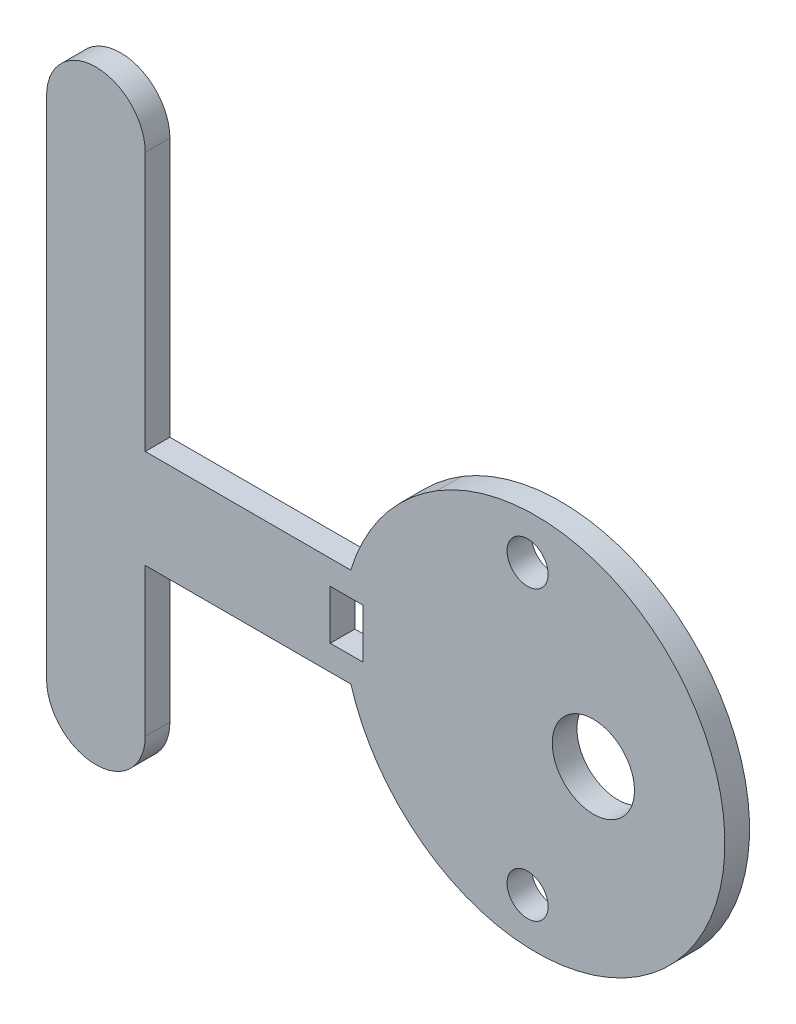
ISO-10303-21;
HEADER;
FILE_DESCRIPTION(('STEP AP214'),'2;1');
FILE_NAME('part.step','',(''),(''),'','','');
FILE_SCHEMA(('AUTOMOTIVE_DESIGN { 1 0 10303 214 1 1 1 1 }'));
ENDSEC;
DATA;
#1=APPLICATION_CONTEXT('core data for automotive mechanical design processes');
#2=APPLICATION_PROTOCOL_DEFINITION('international standard','automotive_design',2000,#1);
#3=PRODUCT_CONTEXT('',#1,'mechanical');
#4=PRODUCT('Part','Part','',(#3));
#5=PRODUCT_RELATED_PRODUCT_CATEGORY('part','',(#4));
#6=PRODUCT_DEFINITION_FORMATION('','',#4);
#7=PRODUCT_DEFINITION_CONTEXT('part definition',#1,'design');
#8=PRODUCT_DEFINITION('design','',#6,#7);
#9=PRODUCT_DEFINITION_SHAPE('','',#8);
#10=(LENGTH_UNIT() NAMED_UNIT(*) SI_UNIT(.MILLI.,.METRE.));
#11=(NAMED_UNIT(*) PLANE_ANGLE_UNIT() SI_UNIT($,.RADIAN.));
#12=(NAMED_UNIT(*) SI_UNIT($,.STERADIAN.) SOLID_ANGLE_UNIT());
#13=UNCERTAINTY_MEASURE_WITH_UNIT(LENGTH_MEASURE(1.E-05),#10,'distance_accuracy_value','');
#14=(GEOMETRIC_REPRESENTATION_CONTEXT(3) GLOBAL_UNCERTAINTY_ASSIGNED_CONTEXT((#13)) GLOBAL_UNIT_ASSIGNED_CONTEXT((#10,
#11,#12)) REPRESENTATION_CONTEXT('',''));
#15=CARTESIAN_POINT('',(0.,0.,0.));
#16=DIRECTION('',(0.,0.,1.));
#17=DIRECTION('',(1.,0.,0.));
#18=AXIS2_PLACEMENT_3D('',#15,#16,#17);
#19=CARTESIAN_POINT('',(98.2041937089408,89.4994362023154,3.));
#20=DIRECTION('',(0.,0.,1.));
#21=DIRECTION('',(1.,0.,0.));
#22=AXIS2_PLACEMENT_3D('',#19,#20,#21);
#23=PLANE('',#22);
#24=DIRECTION('',(0.,1.,0.));
#25=VECTOR('',#24,1.);
#26=CARTESIAN_POINT('',(130.704193708941,55.0489195834403,3.));
#27=LINE('',#26,#25);
#28=CARTESIAN_POINT('',(130.704193708941,49.0489195834403,3.));
#29=VERTEX_POINT('',#28);
#30=CARTESIAN_POINT('',(130.704193708941,55.0489195834403,3.));
#31=VERTEX_POINT('',#30);
#32=EDGE_CURVE('E47',#29,#31,#27,.T.);
#33=ORIENTED_EDGE('',*,*,#32,.F.);
#34=DIRECTION('',(1.,0.,0.));
#35=VECTOR('',#34,1.);
#36=CARTESIAN_POINT('',(126.704193708941,49.0489195834403,3.));
#37=LINE('',#36,#35);
#38=CARTESIAN_POINT('',(126.704193708941,49.0489195834403,3.));
#39=VERTEX_POINT('',#38);
#40=EDGE_CURVE('E151',#39,#29,#37,.T.);
#41=ORIENTED_EDGE('',*,*,#40,.F.);
#42=DIRECTION('',(0.,-1.,0.));
#43=VECTOR('',#42,1.);
#44=CARTESIAN_POINT('',(126.704193708941,55.0489195834403,3.));
#45=LINE('',#44,#43);
#46=CARTESIAN_POINT('',(126.704193708941,55.0489195834403,3.));
#47=VERTEX_POINT('',#46);
#48=EDGE_CURVE('E154',#47,#39,#45,.T.);
#49=ORIENTED_EDGE('',*,*,#48,.F.);
#50=DIRECTION('',(-1.,0.,0.));
#51=VECTOR('',#50,1.);
#52=CARTESIAN_POINT('',(126.704193708941,55.0489195834403,3.));
#53=LINE('',#52,#51);
#54=EDGE_CURVE('E160',#31,#47,#53,.T.);
#55=ORIENTED_EDGE('',*,*,#54,.F.);
#56=EDGE_LOOP('',(#33,#41,#49,#55));
#57=FACE_BOUND('',#56,.T.);
#58=CARTESIAN_POINT('',(150.704193708941,69.5489195834404,3.));
#59=DIRECTION('',(0.,0.,1.));
#60=DIRECTION('',(1.,0.,0.));
#61=AXIS2_PLACEMENT_3D('',#58,#59,#60);
#62=CIRCLE('',#61,2.5);
#63=CARTESIAN_POINT('',(153.204193708941,69.5489195834404,3.));
#64=VERTEX_POINT('',#63);
#65=EDGE_CURVE('E176',#64,#64,#62,.T.);
#66=ORIENTED_EDGE('',*,*,#65,.F.);
#67=EDGE_LOOP('',(#66));
#68=FACE_BOUND('',#67,.T.);
#69=CARTESIAN_POINT('',(98.2041937089408,89.4994362023154,3.));
#70=DIRECTION('',(0.,0.,1.));
#71=DIRECTION('',(1.,0.,0.));
#72=AXIS2_PLACEMENT_3D('',#69,#70,#71);
#73=CIRCLE('',#72,6.00000000000001);
#74=CARTESIAN_POINT('',(104.204193708941,89.4994362023154,3.));
#75=VERTEX_POINT('',#74);
#76=CARTESIAN_POINT('',(92.2041937089408,89.4994362023154,3.));
#77=VERTEX_POINT('',#76);
#78=EDGE_CURVE('E188',#75,#77,#73,.T.);
#79=ORIENTED_EDGE('',*,*,#78,.T.);
#80=DIRECTION('',(0.,-1.,0.));
#81=VECTOR('',#80,1.);
#82=CARTESIAN_POINT('',(92.2041937089408,89.4994362023154,3.));
#83=LINE('',#82,#81);
#84=CARTESIAN_POINT('',(92.2041937089408,27.9994362023154,3.));
#85=VERTEX_POINT('',#84);
#86=EDGE_CURVE('E191',#77,#85,#83,.T.);
#87=ORIENTED_EDGE('',*,*,#86,.T.);
#88=CARTESIAN_POINT('',(98.2041937089409,27.9994362023154,3.));
#89=DIRECTION('',(0.,0.,1.));
#90=DIRECTION('',(1.,0.,0.));
#91=AXIS2_PLACEMENT_3D('',#88,#89,#90);
#92=CIRCLE('',#91,6.00000000000003);
#93=CARTESIAN_POINT('',(104.204193708941,27.9994362023154,3.));
#94=VERTEX_POINT('',#93);
#95=EDGE_CURVE('E194',#85,#94,#92,.T.);
#96=ORIENTED_EDGE('',*,*,#95,.T.);
#97=DIRECTION('',(0.,1.,0.));
#98=VECTOR('',#97,1.);
#99=CARTESIAN_POINT('',(104.204193708941,27.9994362023154,3.));
#100=LINE('',#99,#98);
#101=CARTESIAN_POINT('',(104.204193708941,45.9994362023154,3.));
#102=VERTEX_POINT('',#101);
#103=EDGE_CURVE('E196',#94,#102,#100,.T.);
#104=ORIENTED_EDGE('',*,*,#103,.T.);
#105=DIRECTION('',(1.,0.,0.));
#106=VECTOR('',#105,1.);
#107=CARTESIAN_POINT('',(129.209700495455,45.9994362023154,3.));
#108=LINE('',#107,#106);
#109=CARTESIAN_POINT('',(129.209700495455,45.9994362023154,3.));
#110=VERTEX_POINT('',#109);
#111=EDGE_CURVE('E198',#102,#110,#108,.T.);
#112=ORIENTED_EDGE('',*,*,#111,.T.);
#113=CARTESIAN_POINT('',(152.268649146673,52.9115618881858,3.));
#114=DIRECTION('',(0.,0.,1.));
#115=DIRECTION('',(-1.,0.,0.));
#116=AXIS2_PLACEMENT_3D('',#113,#114,#115);
#117=CIRCLE('',#116,24.0726524171463);
#118=CARTESIAN_POINT('',(139.601041876798,32.441478340409,3.));
#119=VERTEX_POINT('',#118);
#120=EDGE_CURVE('E200',#110,#119,#117,.T.);
#121=ORIENTED_EDGE('',*,*,#120,.T.);
#122=CARTESIAN_POINT('',(151.704193708941,51.9994362023154,3.));
#123=DIRECTION('',(0.,0.,1.));
#124=DIRECTION('',(1.,0.,0.));
#125=AXIS2_PLACEMENT_3D('',#122,#123,#124);
#126=CIRCLE('',#125,23.0000000000002);
#127=CARTESIAN_POINT('',(139.68997160256,71.6121480795283,3.));
#128=VERTEX_POINT('',#127);
#129=EDGE_CURVE('E202',#119,#128,#126,.T.);
#130=ORIENTED_EDGE('',*,*,#129,.T.);
#131=CARTESIAN_POINT('',(152.268676795285,51.0779413244942,3.));
#132=DIRECTION('',(0.,0.,1.));
#133=DIRECTION('',(1.,0.,0.));
#134=AXIS2_PLACEMENT_3D('',#131,#132,#133);
#135=CIRCLE('',#134,24.0806451612901);
#136=CARTESIAN_POINT('',(129.204193708941,57.9994362023154,3.));
#137=VERTEX_POINT('',#136);
#138=EDGE_CURVE('E204',#128,#137,#135,.T.);
#139=ORIENTED_EDGE('',*,*,#138,.T.);
#140=DIRECTION('',(-1.,0.,0.));
#141=VECTOR('',#140,1.);
#142=CARTESIAN_POINT('',(129.204193708941,57.9994362023154,3.));
#143=LINE('',#142,#141);
#144=CARTESIAN_POINT('',(104.204193708941,57.9994362023154,3.));
#145=VERTEX_POINT('',#144);
#146=EDGE_CURVE('E206',#137,#145,#143,.T.);
#147=ORIENTED_EDGE('',*,*,#146,.T.);
#148=DIRECTION('',(0.,1.,0.));
#149=VECTOR('',#148,1.);
#150=CARTESIAN_POINT('',(104.204193708941,89.4994362023154,3.));
#151=LINE('',#150,#149);
#152=EDGE_CURVE('E208',#145,#75,#151,.T.);
#153=ORIENTED_EDGE('',*,*,#152,.T.);
#154=EDGE_LOOP('',(#79,#87,#96,#104,#112,#121,#130,#139,#147,#153));
#155=FACE_BOUND('',#154,.T.);
#156=CARTESIAN_POINT('',(158.704193708941,52.0489195834403,3.));
#157=DIRECTION('',(0.,0.,1.));
#158=DIRECTION('',(1.,0.,0.));
#159=AXIS2_PLACEMENT_3D('',#156,#157,#158);
#160=CIRCLE('',#159,4.99999999999999);
#161=CARTESIAN_POINT('',(163.704193708941,52.0489195834403,3.));
#162=VERTEX_POINT('',#161);
#163=EDGE_CURVE('E182',#162,#162,#160,.T.);
#164=ORIENTED_EDGE('',*,*,#163,.F.);
#165=EDGE_LOOP('',(#164));
#166=FACE_BOUND('',#165,.T.);
#167=CARTESIAN_POINT('',(150.704193708941,34.5489195834404,3.));
#168=DIRECTION('',(0.,0.,1.));
#169=DIRECTION('',(1.,0.,0.));
#170=AXIS2_PLACEMENT_3D('',#167,#168,#169);
#171=CIRCLE('',#170,2.5);
#172=CARTESIAN_POINT('',(153.204193708941,34.5489195834404,3.));
#173=VERTEX_POINT('',#172);
#174=EDGE_CURVE('E170',#173,#173,#171,.T.);
#175=ORIENTED_EDGE('',*,*,#174,.F.);
#176=EDGE_LOOP('',(#175));
#177=FACE_BOUND('',#176,.T.);
#178=ADVANCED_FACE('F32',(#57,#68,#155,#166,#177),#23,.T.);
#179=CARTESIAN_POINT('',(98.2041937089408,89.4994362023154,0.));
#180=DIRECTION('',(0.,0.,1.));
#181=DIRECTION('',(1.,0.,0.));
#182=AXIS2_PLACEMENT_3D('',#179,#180,#181);
#183=PLANE('',#182);
#184=DIRECTION('',(1.,0.,0.));
#185=VECTOR('',#184,1.);
#186=CARTESIAN_POINT('',(126.704193708941,49.0489195834403,0.));
#187=LINE('',#186,#185);
#188=CARTESIAN_POINT('',(126.704193708941,49.0489195834403,0.));
#189=VERTEX_POINT('',#188);
#190=CARTESIAN_POINT('',(130.704193708941,49.0489195834403,0.));
#191=VERTEX_POINT('',#190);
#192=EDGE_CURVE('E141',#189,#191,#187,.T.);
#193=ORIENTED_EDGE('',*,*,#192,.T.);
#194=DIRECTION('',(0.,1.,0.));
#195=VECTOR('',#194,1.);
#196=CARTESIAN_POINT('',(130.704193708941,55.0489195834403,0.));
#197=LINE('',#196,#195);
#198=CARTESIAN_POINT('',(130.704193708941,55.0489195834403,0.));
#199=VERTEX_POINT('',#198);
#200=EDGE_CURVE('E135',#191,#199,#197,.T.);
#201=ORIENTED_EDGE('',*,*,#200,.T.);
#202=DIRECTION('',(-1.,0.,0.));
#203=VECTOR('',#202,1.);
#204=CARTESIAN_POINT('',(126.704193708941,55.0489195834403,0.));
#205=LINE('',#204,#203);
#206=CARTESIAN_POINT('',(126.704193708941,55.0489195834403,0.));
#207=VERTEX_POINT('',#206);
#208=EDGE_CURVE('E144',#199,#207,#205,.T.);
#209=ORIENTED_EDGE('',*,*,#208,.T.);
#210=DIRECTION('',(0.,-1.,0.));
#211=VECTOR('',#210,1.);
#212=CARTESIAN_POINT('',(126.704193708941,55.0489195834403,0.));
#213=LINE('',#212,#211);
#214=EDGE_CURVE('E55',#207,#189,#213,.T.);
#215=ORIENTED_EDGE('',*,*,#214,.T.);
#216=EDGE_LOOP('',(#193,#201,#209,#215));
#217=FACE_BOUND('',#216,.T.);
#218=CARTESIAN_POINT('',(98.2041937089408,89.4994362023154,0.));
#219=DIRECTION('',(0.,0.,1.));
#220=DIRECTION('',(1.,0.,0.));
#221=AXIS2_PLACEMENT_3D('',#218,#219,#220);
#222=CIRCLE('',#221,6.00000000000001);
#223=CARTESIAN_POINT('',(104.204193708941,89.4994362023154,0.));
#224=VERTEX_POINT('',#223);
#225=CARTESIAN_POINT('',(92.2041937089408,89.4994362023154,0.));
#226=VERTEX_POINT('',#225);
#227=EDGE_CURVE('E185',#224,#226,#222,.T.);
#228=ORIENTED_EDGE('',*,*,#227,.F.);
#229=DIRECTION('',(0.,1.,0.));
#230=VECTOR('',#229,1.);
#231=CARTESIAN_POINT('',(104.204193708941,89.4994362023154,0.));
#232=LINE('',#231,#230);
#233=CARTESIAN_POINT('',(104.204193708941,57.9994362023154,0.));
#234=VERTEX_POINT('',#233);
#235=EDGE_CURVE('E192',#234,#224,#232,.T.);
#236=ORIENTED_EDGE('',*,*,#235,.F.);
#237=DIRECTION('',(-1.,0.,0.));
#238=VECTOR('',#237,1.);
#239=CARTESIAN_POINT('',(129.204193708941,57.9994362023154,0.));
#240=LINE('',#239,#238);
#241=CARTESIAN_POINT('',(129.204193708941,57.9994362023154,0.));
#242=VERTEX_POINT('',#241);
#243=EDGE_CURVE('E227',#242,#234,#240,.T.);
#244=ORIENTED_EDGE('',*,*,#243,.F.);
#245=CARTESIAN_POINT('',(152.268676795285,51.0779413244942,0.));
#246=DIRECTION('',(0.,0.,1.));
#247=DIRECTION('',(1.,0.,0.));
#248=AXIS2_PLACEMENT_3D('',#245,#246,#247);
#249=CIRCLE('',#248,24.0806451612901);
#250=CARTESIAN_POINT('',(139.68997160256,71.6121480795283,0.));
#251=VERTEX_POINT('',#250);
#252=EDGE_CURVE('E225',#251,#242,#249,.T.);
#253=ORIENTED_EDGE('',*,*,#252,.F.);
#254=CARTESIAN_POINT('',(151.704193708941,51.9994362023154,0.));
#255=DIRECTION('',(0.,0.,1.));
#256=DIRECTION('',(1.,0.,0.));
#257=AXIS2_PLACEMENT_3D('',#254,#255,#256);
#258=CIRCLE('',#257,23.0000000000002);
#259=CARTESIAN_POINT('',(139.601041876798,32.441478340409,0.));
#260=VERTEX_POINT('',#259);
#261=EDGE_CURVE('E223',#260,#251,#258,.T.);
#262=ORIENTED_EDGE('',*,*,#261,.F.);
#263=CARTESIAN_POINT('',(152.268649146673,52.9115618881858,0.));
#264=DIRECTION('',(0.,0.,1.));
#265=DIRECTION('',(-1.,0.,0.));
#266=AXIS2_PLACEMENT_3D('',#263,#264,#265);
#267=CIRCLE('',#266,24.0726524171463);
#268=CARTESIAN_POINT('',(129.209700495455,45.9994362023154,0.));
#269=VERTEX_POINT('',#268);
#270=EDGE_CURVE('E221',#269,#260,#267,.T.);
#271=ORIENTED_EDGE('',*,*,#270,.F.);
#272=DIRECTION('',(1.,0.,0.));
#273=VECTOR('',#272,1.);
#274=CARTESIAN_POINT('',(129.209700495455,45.9994362023154,0.));
#275=LINE('',#274,#273);
#276=CARTESIAN_POINT('',(104.204193708941,45.9994362023154,0.));
#277=VERTEX_POINT('',#276);
#278=EDGE_CURVE('E219',#277,#269,#275,.T.);
#279=ORIENTED_EDGE('',*,*,#278,.F.);
#280=DIRECTION('',(0.,1.,0.));
#281=VECTOR('',#280,1.);
#282=CARTESIAN_POINT('',(104.204193708941,27.9994362023154,0.));
#283=LINE('',#282,#281);
#284=CARTESIAN_POINT('',(104.204193708941,27.9994362023154,0.));
#285=VERTEX_POINT('',#284);
#286=EDGE_CURVE('E217',#285,#277,#283,.T.);
#287=ORIENTED_EDGE('',*,*,#286,.F.);
#288=CARTESIAN_POINT('',(98.2041937089409,27.9994362023154,0.));
#289=DIRECTION('',(0.,0.,1.));
#290=DIRECTION('',(1.,0.,0.));
#291=AXIS2_PLACEMENT_3D('',#288,#289,#290);
#292=CIRCLE('',#291,6.00000000000003);
#293=CARTESIAN_POINT('',(92.2041937089408,27.9994362023154,0.));
#294=VERTEX_POINT('',#293);
#295=EDGE_CURVE('E215',#294,#285,#292,.T.);
#296=ORIENTED_EDGE('',*,*,#295,.F.);
#297=DIRECTION('',(0.,-1.,0.));
#298=VECTOR('',#297,1.);
#299=CARTESIAN_POINT('',(92.2041937089408,89.4994362023154,0.));
#300=LINE('',#299,#298);
#301=EDGE_CURVE('E213',#226,#294,#300,.T.);
#302=ORIENTED_EDGE('',*,*,#301,.F.);
#303=EDGE_LOOP('',(#228,#236,#244,#253,#262,#271,#279,#287,#296,#302));
#304=FACE_BOUND('',#303,.T.);
#305=CARTESIAN_POINT('',(158.704193708941,52.0489195834403,0.));
#306=DIRECTION('',(0.,0.,1.));
#307=DIRECTION('',(1.,0.,0.));
#308=AXIS2_PLACEMENT_3D('',#305,#306,#307);
#309=CIRCLE('',#308,4.99999999999999);
#310=CARTESIAN_POINT('',(163.704193708941,52.0489195834403,0.));
#311=VERTEX_POINT('',#310);
#312=EDGE_CURVE('E179',#311,#311,#309,.T.);
#313=ORIENTED_EDGE('',*,*,#312,.T.);
#314=EDGE_LOOP('',(#313));
#315=FACE_BOUND('',#314,.T.);
#316=CARTESIAN_POINT('',(150.704193708941,69.5489195834404,0.));
#317=DIRECTION('',(0.,0.,1.));
#318=DIRECTION('',(1.,0.,0.));
#319=AXIS2_PLACEMENT_3D('',#316,#317,#318);
#320=CIRCLE('',#319,2.5);
#321=CARTESIAN_POINT('',(153.204193708941,69.5489195834404,0.));
#322=VERTEX_POINT('',#321);
#323=EDGE_CURVE('E173',#322,#322,#320,.T.);
#324=ORIENTED_EDGE('',*,*,#323,.T.);
#325=EDGE_LOOP('',(#324));
#326=FACE_BOUND('',#325,.T.);
#327=CARTESIAN_POINT('',(150.704193708941,34.5489195834404,0.));
#328=DIRECTION('',(0.,0.,1.));
#329=DIRECTION('',(1.,0.,0.));
#330=AXIS2_PLACEMENT_3D('',#327,#328,#329);
#331=CIRCLE('',#330,2.5);
#332=CARTESIAN_POINT('',(153.204193708941,34.5489195834404,0.));
#333=VERTEX_POINT('',#332);
#334=EDGE_CURVE('E166',#333,#333,#331,.T.);
#335=ORIENTED_EDGE('',*,*,#334,.T.);
#336=EDGE_LOOP('',(#335));
#337=FACE_BOUND('',#336,.T.);
#338=ADVANCED_FACE('F148',(#217,#304,#315,#326,#337),#183,.F.);
#339=CARTESIAN_POINT('',(98.2041937089408,89.4994362023154,3.));
#340=DIRECTION('',(0.,0.,-1.));
#341=DIRECTION('',(-1.,0.,0.));
#342=AXIS2_PLACEMENT_3D('',#339,#340,#341);
#343=CYLINDRICAL_SURFACE('',#342,6.00000000000001);
#344=ORIENTED_EDGE('',*,*,#227,.T.);
#345=DIRECTION('',(0.,0.,-1.));
#346=VECTOR('',#345,1.);
#347=CARTESIAN_POINT('',(92.2041937089408,89.4994362023154,3.));
#348=LINE('',#347,#346);
#349=EDGE_CURVE('E11',#77,#226,#348,.T.);
#350=ORIENTED_EDGE('',*,*,#349,.F.);
#351=ORIENTED_EDGE('',*,*,#78,.F.);
#352=DIRECTION('',(0.,0.,-1.));
#353=VECTOR('',#352,1.);
#354=CARTESIAN_POINT('',(104.204193708941,89.4994362023154,3.));
#355=LINE('',#354,#353);
#356=EDGE_CURVE('E210',#75,#224,#355,.T.);
#357=ORIENTED_EDGE('',*,*,#356,.T.);
#358=EDGE_LOOP('',(#344,#350,#351,#357));
#359=FACE_BOUND('',#358,.T.);
#360=ADVANCED_FACE('F34',(#359),#343,.T.);
#361=CARTESIAN_POINT('',(92.2041937089408,89.4994362023154,3.));
#362=DIRECTION('',(1.,0.,0.));
#363=DIRECTION('',(0.,1.,0.));
#364=AXIS2_PLACEMENT_3D('',#361,#362,#363);
#365=PLANE('',#364);
#366=ORIENTED_EDGE('',*,*,#301,.T.);
#367=DIRECTION('',(0.,0.,-1.));
#368=VECTOR('',#367,1.);
#369=CARTESIAN_POINT('',(92.2041937089408,27.9994362023154,3.));
#370=LINE('',#369,#368);
#371=EDGE_CURVE('E40',#85,#294,#370,.T.);
#372=ORIENTED_EDGE('',*,*,#371,.F.);
#373=ORIENTED_EDGE('',*,*,#86,.F.);
#374=ORIENTED_EDGE('',*,*,#349,.T.);
#375=EDGE_LOOP('',(#366,#372,#373,#374));
#376=FACE_BOUND('',#375,.T.);
#377=ADVANCED_FACE('F279',(#376),#365,.F.);
#378=CARTESIAN_POINT('',(98.2041937089409,27.9994362023154,3.));
#379=DIRECTION('',(0.,0.,-1.));
#380=DIRECTION('',(-1.,0.,0.));
#381=AXIS2_PLACEMENT_3D('',#378,#379,#380);
#382=CYLINDRICAL_SURFACE('',#381,6.00000000000003);
#383=ORIENTED_EDGE('',*,*,#295,.T.);
#384=DIRECTION('',(0.,0.,-1.));
#385=VECTOR('',#384,1.);
#386=CARTESIAN_POINT('',(104.204193708941,27.9994362023154,3.));
#387=LINE('',#386,#385);
#388=EDGE_CURVE('E250',#94,#285,#387,.T.);
#389=ORIENTED_EDGE('',*,*,#388,.F.);
#390=ORIENTED_EDGE('',*,*,#95,.F.);
#391=ORIENTED_EDGE('',*,*,#371,.T.);
#392=EDGE_LOOP('',(#383,#389,#390,#391));
#393=FACE_BOUND('',#392,.T.);
#394=ADVANCED_FACE('F257',(#393),#382,.T.);
#395=CARTESIAN_POINT('',(104.204193708941,27.9994362023154,3.));
#396=DIRECTION('',(-1.,0.,0.));
#397=DIRECTION('',(0.,-1.,0.));
#398=AXIS2_PLACEMENT_3D('',#395,#396,#397);
#399=PLANE('',#398);
#400=ORIENTED_EDGE('',*,*,#286,.T.);
#401=DIRECTION('',(0.,0.,-1.));
#402=VECTOR('',#401,1.);
#403=CARTESIAN_POINT('',(104.204193708941,45.9994362023154,3.));
#404=LINE('',#403,#402);
#405=EDGE_CURVE('E247',#102,#277,#404,.T.);
#406=ORIENTED_EDGE('',*,*,#405,.F.);
#407=ORIENTED_EDGE('',*,*,#103,.F.);
#408=ORIENTED_EDGE('',*,*,#388,.T.);
#409=EDGE_LOOP('',(#400,#406,#407,#408));
#410=FACE_BOUND('',#409,.T.);
#411=ADVANCED_FACE('F267',(#410),#399,.F.);
#412=CARTESIAN_POINT('',(129.209700495455,45.9994362023154,3.));
#413=DIRECTION('',(0.,1.,0.));
#414=DIRECTION('',(0.,0.,1.));
#415=AXIS2_PLACEMENT_3D('',#412,#413,#414);
#416=PLANE('',#415);
#417=ORIENTED_EDGE('',*,*,#278,.T.);
#418=DIRECTION('',(0.,0.,-1.));
#419=VECTOR('',#418,1.);
#420=CARTESIAN_POINT('',(129.209700495455,45.9994362023154,3.));
#421=LINE('',#420,#419);
#422=EDGE_CURVE('E244',#110,#269,#421,.T.);
#423=ORIENTED_EDGE('',*,*,#422,.F.);
#424=ORIENTED_EDGE('',*,*,#111,.F.);
#425=ORIENTED_EDGE('',*,*,#405,.T.);
#426=EDGE_LOOP('',(#417,#423,#424,#425));
#427=FACE_BOUND('',#426,.T.);
#428=ADVANCED_FACE('F271',(#427),#416,.F.);
#429=CARTESIAN_POINT('',(152.268649146673,52.9115618881858,3.));
#430=DIRECTION('',(0.,0.,-1.));
#431=DIRECTION('',(-1.,0.,0.));
#432=AXIS2_PLACEMENT_3D('',#429,#430,#431);
#433=CYLINDRICAL_SURFACE('',#432,24.0726524171463);
#434=ORIENTED_EDGE('',*,*,#270,.T.);
#435=DIRECTION('',(0.,0.,-1.));
#436=VECTOR('',#435,1.);
#437=CARTESIAN_POINT('',(139.601041876798,32.441478340409,3.));
#438=LINE('',#437,#436);
#439=EDGE_CURVE('E241',#119,#260,#438,.T.);
#440=ORIENTED_EDGE('',*,*,#439,.F.);
#441=ORIENTED_EDGE('',*,*,#120,.F.);
#442=ORIENTED_EDGE('',*,*,#422,.T.);
#443=EDGE_LOOP('',(#434,#440,#441,#442));
#444=FACE_BOUND('',#443,.T.);
#445=ADVANCED_FACE('F302',(#444),#433,.T.);
#446=CARTESIAN_POINT('',(151.704193708941,51.9994362023154,3.));
#447=DIRECTION('',(0.,0.,-1.));
#448=DIRECTION('',(-1.,0.,0.));
#449=AXIS2_PLACEMENT_3D('',#446,#447,#448);
#450=CYLINDRICAL_SURFACE('',#449,23.0000000000002);
#451=ORIENTED_EDGE('',*,*,#261,.T.);
#452=DIRECTION('',(0.,0.,-1.));
#453=VECTOR('',#452,1.);
#454=CARTESIAN_POINT('',(139.68997160256,71.6121480795283,3.));
#455=LINE('',#454,#453);
#456=EDGE_CURVE('E238',#128,#251,#455,.T.);
#457=ORIENTED_EDGE('',*,*,#456,.F.);
#458=ORIENTED_EDGE('',*,*,#129,.F.);
#459=ORIENTED_EDGE('',*,*,#439,.T.);
#460=EDGE_LOOP('',(#451,#457,#458,#459));
#461=FACE_BOUND('',#460,.T.);
#462=ADVANCED_FACE('F299',(#461),#450,.T.);
#463=CARTESIAN_POINT('',(152.268676795285,51.0779413244942,3.));
#464=DIRECTION('',(0.,0.,-1.));
#465=DIRECTION('',(-1.,0.,0.));
#466=AXIS2_PLACEMENT_3D('',#463,#464,#465);
#467=CYLINDRICAL_SURFACE('',#466,24.0806451612901);
#468=ORIENTED_EDGE('',*,*,#252,.T.);
#469=DIRECTION('',(0.,0.,-1.));
#470=VECTOR('',#469,1.);
#471=CARTESIAN_POINT('',(129.204193708941,57.9994362023154,3.));
#472=LINE('',#471,#470);
#473=EDGE_CURVE('E235',#137,#242,#472,.T.);
#474=ORIENTED_EDGE('',*,*,#473,.F.);
#475=ORIENTED_EDGE('',*,*,#138,.F.);
#476=ORIENTED_EDGE('',*,*,#456,.T.);
#477=EDGE_LOOP('',(#468,#474,#475,#476));
#478=FACE_BOUND('',#477,.T.);
#479=ADVANCED_FACE('F295',(#478),#467,.T.);
#480=CARTESIAN_POINT('',(129.204193708941,57.9994362023154,3.));
#481=DIRECTION('',(0.,-1.,0.));
#482=DIRECTION('',(0.,0.,-1.));
#483=AXIS2_PLACEMENT_3D('',#480,#481,#482);
#484=PLANE('',#483);
#485=ORIENTED_EDGE('',*,*,#243,.T.);
#486=DIRECTION('',(0.,0.,-1.));
#487=VECTOR('',#486,1.);
#488=CARTESIAN_POINT('',(104.204193708941,57.9994362023154,3.));
#489=LINE('',#488,#487);
#490=EDGE_CURVE('E232',#145,#234,#489,.T.);
#491=ORIENTED_EDGE('',*,*,#490,.F.);
#492=ORIENTED_EDGE('',*,*,#146,.F.);
#493=ORIENTED_EDGE('',*,*,#473,.T.);
#494=EDGE_LOOP('',(#485,#491,#492,#493));
#495=FACE_BOUND('',#494,.T.);
#496=ADVANCED_FACE('F291',(#495),#484,.F.);
#497=CARTESIAN_POINT('',(104.204193708941,89.4994362023154,3.));
#498=DIRECTION('',(-1.,0.,0.));
#499=DIRECTION('',(0.,-1.,0.));
#500=AXIS2_PLACEMENT_3D('',#497,#498,#499);
#501=PLANE('',#500);
#502=ORIENTED_EDGE('',*,*,#235,.T.);
#503=ORIENTED_EDGE('',*,*,#356,.F.);
#504=ORIENTED_EDGE('',*,*,#152,.F.);
#505=ORIENTED_EDGE('',*,*,#490,.T.);
#506=EDGE_LOOP('',(#502,#503,#504,#505));
#507=FACE_BOUND('',#506,.T.);
#508=ADVANCED_FACE('F286',(#507),#501,.F.);
#509=CARTESIAN_POINT('',(158.704193708941,52.0489195834403,3.));
#510=DIRECTION('',(0.,0.,-1.));
#511=DIRECTION('',(-1.,0.,0.));
#512=AXIS2_PLACEMENT_3D('',#509,#510,#511);
#513=CYLINDRICAL_SURFACE('',#512,4.99999999999999);
#514=ORIENTED_EDGE('',*,*,#163,.T.);
#515=EDGE_LOOP('',(#514));
#516=FACE_BOUND('',#515,.T.);
#517=ORIENTED_EDGE('',*,*,#312,.F.);
#518=EDGE_LOOP('',(#517));
#519=FACE_BOUND('',#518,.T.);
#520=ADVANCED_FACE('F320',(#516,#519),#513,.F.);
#521=CARTESIAN_POINT('',(150.704193708941,69.5489195834404,3.));
#522=DIRECTION('',(0.,0.,-1.));
#523=DIRECTION('',(-1.,0.,0.));
#524=AXIS2_PLACEMENT_3D('',#521,#522,#523);
#525=CYLINDRICAL_SURFACE('',#524,2.5);
#526=ORIENTED_EDGE('',*,*,#65,.T.);
#527=EDGE_LOOP('',(#526));
#528=FACE_BOUND('',#527,.T.);
#529=ORIENTED_EDGE('',*,*,#323,.F.);
#530=EDGE_LOOP('',(#529));
#531=FACE_BOUND('',#530,.T.);
#532=ADVANCED_FACE('F346',(#528,#531),#525,.F.);
#533=CARTESIAN_POINT('',(150.704193708941,34.5489195834404,3.));
#534=DIRECTION('',(0.,0.,-1.));
#535=DIRECTION('',(-1.,0.,0.));
#536=AXIS2_PLACEMENT_3D('',#533,#534,#535);
#537=CYLINDRICAL_SURFACE('',#536,2.5);
#538=ORIENTED_EDGE('',*,*,#174,.T.);
#539=EDGE_LOOP('',(#538));
#540=FACE_BOUND('',#539,.T.);
#541=ORIENTED_EDGE('',*,*,#334,.F.);
#542=EDGE_LOOP('',(#541));
#543=FACE_BOUND('',#542,.T.);
#544=ADVANCED_FACE('F353',(#540,#543),#537,.F.);
#545=CARTESIAN_POINT('',(130.704193708941,55.0489195834403,0.));
#546=DIRECTION('',(1.,0.,0.));
#547=DIRECTION('',(0.,0.,-1.));
#548=AXIS2_PLACEMENT_3D('',#545,#546,#547);
#549=PLANE('',#548);
#550=ORIENTED_EDGE('',*,*,#32,.T.);
#551=DIRECTION('',(0.,0.,1.));
#552=VECTOR('',#551,1.);
#553=CARTESIAN_POINT('',(130.704193708941,55.0489195834403,0.));
#554=LINE('',#553,#552);
#555=EDGE_CURVE('E131',#199,#31,#554,.T.);
#556=ORIENTED_EDGE('',*,*,#555,.F.);
#557=ORIENTED_EDGE('',*,*,#200,.F.);
#558=DIRECTION('',(0.,0.,1.));
#559=VECTOR('',#558,1.);
#560=CARTESIAN_POINT('',(130.704193708941,49.0489195834403,0.));
#561=LINE('',#560,#559);
#562=EDGE_CURVE('E164',#191,#29,#561,.T.);
#563=ORIENTED_EDGE('',*,*,#562,.T.);
#564=EDGE_LOOP('',(#550,#556,#557,#563));
#565=FACE_BOUND('',#564,.T.);
#566=ADVANCED_FACE('F133',(#565),#549,.F.);
#567=CARTESIAN_POINT('',(126.704193708941,49.0489195834403,0.));
#568=DIRECTION('',(0.,-1.,0.));
#569=DIRECTION('',(0.,0.,-1.));
#570=AXIS2_PLACEMENT_3D('',#567,#568,#569);
#571=PLANE('',#570);
#572=ORIENTED_EDGE('',*,*,#40,.T.);
#573=ORIENTED_EDGE('',*,*,#562,.F.);
#574=ORIENTED_EDGE('',*,*,#192,.F.);
#575=DIRECTION('',(0.,0.,1.));
#576=VECTOR('',#575,1.);
#577=CARTESIAN_POINT('',(126.704193708941,49.0489195834403,0.));
#578=LINE('',#577,#576);
#579=EDGE_CURVE('E167',#189,#39,#578,.T.);
#580=ORIENTED_EDGE('',*,*,#579,.T.);
#581=EDGE_LOOP('',(#572,#573,#574,#580));
#582=FACE_BOUND('',#581,.T.);
#583=ADVANCED_FACE('F367',(#582),#571,.F.);
#584=CARTESIAN_POINT('',(126.704193708941,55.0489195834403,0.));
#585=DIRECTION('',(-1.,0.,0.));
#586=DIRECTION('',(0.,0.,1.));
#587=AXIS2_PLACEMENT_3D('',#584,#585,#586);
#588=PLANE('',#587);
#589=ORIENTED_EDGE('',*,*,#48,.T.);
#590=ORIENTED_EDGE('',*,*,#579,.F.);
#591=ORIENTED_EDGE('',*,*,#214,.F.);
#592=DIRECTION('',(0.,0.,1.));
#593=VECTOR('',#592,1.);
#594=CARTESIAN_POINT('',(126.704193708941,55.0489195834403,0.));
#595=LINE('',#594,#593);
#596=EDGE_CURVE('E140',#207,#47,#595,.T.);
#597=ORIENTED_EDGE('',*,*,#596,.T.);
#598=EDGE_LOOP('',(#589,#590,#591,#597));
#599=FACE_BOUND('',#598,.T.);
#600=ADVANCED_FACE('F375',(#599),#588,.F.);
#601=CARTESIAN_POINT('',(126.704193708941,55.0489195834403,0.));
#602=DIRECTION('',(0.,1.,0.));
#603=DIRECTION('',(0.,0.,1.));
#604=AXIS2_PLACEMENT_3D('',#601,#602,#603);
#605=PLANE('',#604);
#606=ORIENTED_EDGE('',*,*,#54,.T.);
#607=ORIENTED_EDGE('',*,*,#596,.F.);
#608=ORIENTED_EDGE('',*,*,#208,.F.);
#609=ORIENTED_EDGE('',*,*,#555,.T.);
#610=EDGE_LOOP('',(#606,#607,#608,#609));
#611=FACE_BOUND('',#610,.T.);
#612=ADVANCED_FACE('F145',(#611),#605,.F.);
#613=CLOSED_SHELL('',(#178,#338,#360,#377,#394,#411,#428,#445,#462,#479,#496,#508,#520,#532,
#544,#566,#583,#600,#612));
#614=MANIFOLD_SOLID_BREP('B2',#613);
#615=ADVANCED_BREP_SHAPE_REPRESENTATION('',(#18,#614),#14);
#616=SHAPE_DEFINITION_REPRESENTATION(#9,#615);
ENDSEC;
END-ISO-10303-21;
